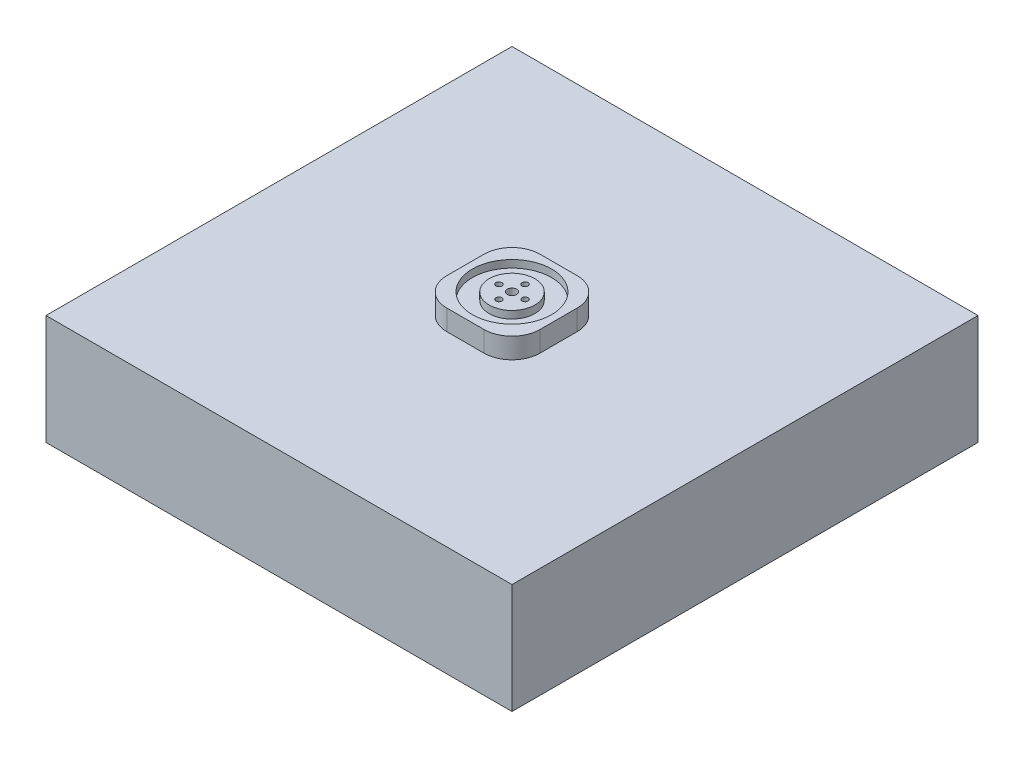
ISO-10303-21;
HEADER;
FILE_DESCRIPTION(('STEP AP214'),'2;1');
FILE_NAME('part.step','',(''),(''),'','','');
FILE_SCHEMA(('AUTOMOTIVE_DESIGN { 1 0 10303 214 1 1 1 1 }'));
ENDSEC;
DATA;
#1=APPLICATION_CONTEXT('core data for automotive mechanical design processes');
#2=APPLICATION_PROTOCOL_DEFINITION('international standard','automotive_design',2000,#1);
#3=PRODUCT_CONTEXT('',#1,'mechanical');
#4=PRODUCT('Part','Part','',(#3));
#5=PRODUCT_RELATED_PRODUCT_CATEGORY('part','',(#4));
#6=PRODUCT_DEFINITION_FORMATION('','',#4);
#7=PRODUCT_DEFINITION_CONTEXT('part definition',#1,'design');
#8=PRODUCT_DEFINITION('design','',#6,#7);
#9=PRODUCT_DEFINITION_SHAPE('','',#8);
#10=(LENGTH_UNIT() NAMED_UNIT(*) SI_UNIT(.MILLI.,.METRE.));
#11=(NAMED_UNIT(*) PLANE_ANGLE_UNIT() SI_UNIT($,.RADIAN.));
#12=(NAMED_UNIT(*) SI_UNIT($,.STERADIAN.) SOLID_ANGLE_UNIT());
#13=UNCERTAINTY_MEASURE_WITH_UNIT(LENGTH_MEASURE(1.E-05),#10,'distance_accuracy_value','');
#14=(GEOMETRIC_REPRESENTATION_CONTEXT(3) GLOBAL_UNCERTAINTY_ASSIGNED_CONTEXT((#13)) GLOBAL_UNIT_ASSIGNED_CONTEXT((#10,
#11,#12)) REPRESENTATION_CONTEXT('',''));
#15=CARTESIAN_POINT('',(0.,0.,0.));
#16=DIRECTION('',(0.,0.,1.));
#17=DIRECTION('',(1.,0.,0.));
#18=AXIS2_PLACEMENT_3D('',#15,#16,#17);
#19=CARTESIAN_POINT('',(-22.5,0.,44.));
#20=DIRECTION('',(0.,1.,0.));
#21=DIRECTION('',(0.,0.,1.));
#22=AXIS2_PLACEMENT_3D('',#19,#20,#21);
#23=PLANE('',#22);
#24=DIRECTION('',(-1.,0.,0.));
#25=VECTOR('',#24,1.);
#26=CARTESIAN_POINT('',(-60.855,0.,82.8559125763435));
#27=LINE('',#26,#25);
#28=CARTESIAN_POINT('',(60.855,0.,82.8559125763435));
#29=VERTEX_POINT('',#28);
#30=CARTESIAN_POINT('',(-60.855,0.,82.8559125763435));
#31=VERTEX_POINT('',#30);
#32=EDGE_CURVE('E172',#29,#31,#27,.T.);
#33=ORIENTED_EDGE('',*,*,#32,.T.);
#34=DIRECTION('',(0.,0.,-1.));
#35=VECTOR('',#34,1.);
#36=CARTESIAN_POINT('',(-60.855,0.,82.8559125763435));
#37=LINE('',#36,#35);
#38=CARTESIAN_POINT('',(-60.855,0.,-38.8559125763435));
#39=VERTEX_POINT('',#38);
#40=EDGE_CURVE('E191',#31,#39,#37,.T.);
#41=ORIENTED_EDGE('',*,*,#40,.T.);
#42=DIRECTION('',(1.,0.,0.));
#43=VECTOR('',#42,1.);
#44=CARTESIAN_POINT('',(-60.855,0.,-38.8559125763435));
#45=LINE('',#44,#43);
#46=CARTESIAN_POINT('',(60.855,0.,-38.8559125763435));
#47=VERTEX_POINT('',#46);
#48=EDGE_CURVE('E178',#39,#47,#45,.T.);
#49=ORIENTED_EDGE('',*,*,#48,.T.);
#50=DIRECTION('',(0.,0.,1.));
#51=VECTOR('',#50,1.);
#52=CARTESIAN_POINT('',(60.855,0.,82.8559125763435));
#53=LINE('',#52,#51);
#54=EDGE_CURVE('E194',#47,#29,#53,.T.);
#55=ORIENTED_EDGE('',*,*,#54,.T.);
#56=EDGE_LOOP('',(#33,#41,#49,#55));
#57=FACE_BOUND('',#56,.T.);
#58=CARTESIAN_POINT('',(-7.,0.,21.9999999999999));
#59=DIRECTION('',(0.,-1.,0.));
#60=DIRECTION('',(0.,0.,-1.));
#61=AXIS2_PLACEMENT_3D('',#58,#59,#60);
#62=CIRCLE('',#61,3.);
#63=CARTESIAN_POINT('',(-7.,0.,18.9999999999999));
#64=VERTEX_POINT('',#63);
#65=EDGE_CURVE('E217',#64,#64,#62,.T.);
#66=ORIENTED_EDGE('',*,*,#65,.F.);
#67=EDGE_LOOP('',(#66));
#68=FACE_BOUND('',#67,.T.);
#69=CARTESIAN_POINT('',(0.,0.,15.));
#70=DIRECTION('',(0.,-1.,0.));
#71=DIRECTION('',(0.,0.,-1.));
#72=AXIS2_PLACEMENT_3D('',#69,#70,#71);
#73=CIRCLE('',#72,3.);
#74=CARTESIAN_POINT('',(0.,0.,12.));
#75=VERTEX_POINT('',#74);
#76=EDGE_CURVE('E245',#75,#75,#73,.T.);
#77=ORIENTED_EDGE('',*,*,#76,.F.);
#78=EDGE_LOOP('',(#77));
#79=FACE_BOUND('',#78,.T.);
#80=CARTESIAN_POINT('',(7.,0.,22.));
#81=DIRECTION('',(0.,-1.,0.));
#82=DIRECTION('',(0.,0.,-1.));
#83=AXIS2_PLACEMENT_3D('',#80,#81,#82);
#84=CIRCLE('',#83,3.);
#85=CARTESIAN_POINT('',(7.,0.,19.));
#86=VERTEX_POINT('',#85);
#87=EDGE_CURVE('E239',#86,#86,#84,.T.);
#88=ORIENTED_EDGE('',*,*,#87,.F.);
#89=EDGE_LOOP('',(#88));
#90=FACE_BOUND('',#89,.T.);
#91=CARTESIAN_POINT('',(0.,0.,29.));
#92=DIRECTION('',(0.,-1.,0.));
#93=DIRECTION('',(0.,0.,-1.));
#94=AXIS2_PLACEMENT_3D('',#91,#92,#93);
#95=CIRCLE('',#94,3.);
#96=CARTESIAN_POINT('',(0.,0.,26.));
#97=VERTEX_POINT('',#96);
#98=EDGE_CURVE('E231',#97,#97,#95,.T.);
#99=ORIENTED_EDGE('',*,*,#98,.F.);
#100=EDGE_LOOP('',(#99));
#101=FACE_BOUND('',#100,.T.);
#102=ADVANCED_FACE('F47',(#57,#68,#79,#90,#101),#23,.F.);
#103=CARTESIAN_POINT('',(25.,20.,47.));
#104=DIRECTION('',(-1.,0.,0.));
#105=DIRECTION('',(0.,-1.,0.));
#106=AXIS2_PLACEMENT_3D('',#103,#104,#105);
#107=PLANE('',#106);
#108=DIRECTION('',(0.,0.,-1.));
#109=VECTOR('',#108,1.);
#110=CARTESIAN_POINT('',(25.,9.00000000000001,47.));
#111=LINE('',#110,#109);
#112=CARTESIAN_POINT('',(25.,9.00000000000001,32.));
#113=VERTEX_POINT('',#112);
#114=CARTESIAN_POINT('',(25.,9.00000000000001,12.));
#115=VERTEX_POINT('',#114);
#116=EDGE_CURVE('E283',#113,#115,#111,.T.);
#117=ORIENTED_EDGE('',*,*,#116,.T.);
#118=DIRECTION('',(0.,-1.,0.));
#119=VECTOR('',#118,1.);
#120=CARTESIAN_POINT('',(25.,20.,12.));
#121=LINE('',#120,#119);
#122=CARTESIAN_POINT('',(25.,20.,12.));
#123=VERTEX_POINT('',#122);
#124=EDGE_CURVE('E12',#115,#123,#121,.F.);
#125=ORIENTED_EDGE('',*,*,#124,.T.);
#126=DIRECTION('',(0.,0.,-1.));
#127=VECTOR('',#126,1.);
#128=CARTESIAN_POINT('',(25.,20.,47.));
#129=LINE('',#128,#127);
#130=CARTESIAN_POINT('',(25.,20.,32.));
#131=VERTEX_POINT('',#130);
#132=EDGE_CURVE('E286',#131,#123,#129,.T.);
#133=ORIENTED_EDGE('',*,*,#132,.F.);
#134=DIRECTION('',(0.,-1.,0.));
#135=VECTOR('',#134,1.);
#136=CARTESIAN_POINT('',(25.,20.,32.));
#137=LINE('',#136,#135);
#138=EDGE_CURVE('E56',#131,#113,#137,.T.);
#139=ORIENTED_EDGE('',*,*,#138,.T.);
#140=EDGE_LOOP('',(#117,#125,#133,#139));
#141=FACE_BOUND('',#140,.T.);
#142=ADVANCED_FACE('F372',(#141),#107,.F.);
#143=CARTESIAN_POINT('',(-25.,20.,-3.));
#144=DIRECTION('',(0.,0.,1.));
#145=DIRECTION('',(1.,0.,0.));
#146=AXIS2_PLACEMENT_3D('',#143,#144,#145);
#147=PLANE('',#146);
#148=DIRECTION('',(-1.,0.,0.));
#149=VECTOR('',#148,1.);
#150=CARTESIAN_POINT('',(-25.,9.,-3.));
#151=LINE('',#150,#149);
#152=CARTESIAN_POINT('',(10.,9.00000000000001,-3.));
#153=VERTEX_POINT('',#152);
#154=CARTESIAN_POINT('',(-10.,9.,-3.));
#155=VERTEX_POINT('',#154);
#156=EDGE_CURVE('E300',#153,#155,#151,.T.);
#157=ORIENTED_EDGE('',*,*,#156,.T.);
#158=DIRECTION('',(0.,-1.,0.));
#159=VECTOR('',#158,1.);
#160=CARTESIAN_POINT('',(-10.,20.,-3.));
#161=LINE('',#160,#159);
#162=CARTESIAN_POINT('',(-10.,20.,-3.));
#163=VERTEX_POINT('',#162);
#164=EDGE_CURVE('E72',#155,#163,#161,.F.);
#165=ORIENTED_EDGE('',*,*,#164,.T.);
#166=DIRECTION('',(-1.,0.,0.));
#167=VECTOR('',#166,1.);
#168=CARTESIAN_POINT('',(-25.,20.,-3.));
#169=LINE('',#168,#167);
#170=CARTESIAN_POINT('',(10.,20.,-3.));
#171=VERTEX_POINT('',#170);
#172=EDGE_CURVE('E289',#171,#163,#169,.T.);
#173=ORIENTED_EDGE('',*,*,#172,.F.);
#174=DIRECTION('',(0.,-1.,0.));
#175=VECTOR('',#174,1.);
#176=CARTESIAN_POINT('',(10.,20.,-3.));
#177=LINE('',#176,#175);
#178=EDGE_CURVE('E335',#171,#153,#177,.T.);
#179=ORIENTED_EDGE('',*,*,#178,.T.);
#180=EDGE_LOOP('',(#157,#165,#173,#179));
#181=FACE_BOUND('',#180,.T.);
#182=ADVANCED_FACE('F380',(#181),#147,.F.);
#183=CARTESIAN_POINT('',(-25.,20.,47.));
#184=DIRECTION('',(1.,0.,0.));
#185=DIRECTION('',(0.,1.,0.));
#186=AXIS2_PLACEMENT_3D('',#183,#184,#185);
#187=PLANE('',#186);
#188=DIRECTION('',(0.,0.,1.));
#189=VECTOR('',#188,1.);
#190=CARTESIAN_POINT('',(-25.,9.,47.));
#191=LINE('',#190,#189);
#192=CARTESIAN_POINT('',(-25.,9.,12.));
#193=VERTEX_POINT('',#192);
#194=CARTESIAN_POINT('',(-25.,9.,32.));
#195=VERTEX_POINT('',#194);
#196=EDGE_CURVE('E302',#193,#195,#191,.T.);
#197=ORIENTED_EDGE('',*,*,#196,.T.);
#198=DIRECTION('',(0.,-1.,0.));
#199=VECTOR('',#198,1.);
#200=CARTESIAN_POINT('',(-25.,20.,32.));
#201=LINE('',#200,#199);
#202=CARTESIAN_POINT('',(-25.,20.,32.));
#203=VERTEX_POINT('',#202);
#204=EDGE_CURVE('E325',#195,#203,#201,.F.);
#205=ORIENTED_EDGE('',*,*,#204,.T.);
#206=DIRECTION('',(0.,0.,1.));
#207=VECTOR('',#206,1.);
#208=CARTESIAN_POINT('',(-25.,20.,47.));
#209=LINE('',#208,#207);
#210=CARTESIAN_POINT('',(-25.,20.,12.));
#211=VERTEX_POINT('',#210);
#212=EDGE_CURVE('E292',#211,#203,#209,.T.);
#213=ORIENTED_EDGE('',*,*,#212,.F.);
#214=DIRECTION('',(0.,-1.,0.));
#215=VECTOR('',#214,1.);
#216=CARTESIAN_POINT('',(-25.,20.,12.));
#217=LINE('',#216,#215);
#218=EDGE_CURVE('E322',#211,#193,#217,.T.);
#219=ORIENTED_EDGE('',*,*,#218,.T.);
#220=EDGE_LOOP('',(#197,#205,#213,#219));
#221=FACE_BOUND('',#220,.T.);
#222=ADVANCED_FACE('F418',(#221),#187,.F.);
#223=CARTESIAN_POINT('',(-25.,20.,47.));
#224=DIRECTION('',(0.,0.,-1.));
#225=DIRECTION('',(-1.,0.,0.));
#226=AXIS2_PLACEMENT_3D('',#223,#224,#225);
#227=PLANE('',#226);
#228=DIRECTION('',(1.,0.,0.));
#229=VECTOR('',#228,1.);
#230=CARTESIAN_POINT('',(-25.,20.,47.));
#231=LINE('',#230,#229);
#232=CARTESIAN_POINT('',(-10.,20.,47.));
#233=VERTEX_POINT('',#232);
#234=CARTESIAN_POINT('',(10.,20.,47.));
#235=VERTEX_POINT('',#234);
#236=EDGE_CURVE('E295',#233,#235,#231,.T.);
#237=ORIENTED_EDGE('',*,*,#236,.F.);
#238=DIRECTION('',(0.,-1.,0.));
#239=VECTOR('',#238,1.);
#240=CARTESIAN_POINT('',(-10.,20.,47.));
#241=LINE('',#240,#239);
#242=CARTESIAN_POINT('',(-10.,9.,47.));
#243=VERTEX_POINT('',#242);
#244=EDGE_CURVE('E307',#233,#243,#241,.T.);
#245=ORIENTED_EDGE('',*,*,#244,.T.);
#246=DIRECTION('',(1.,0.,0.));
#247=VECTOR('',#246,1.);
#248=CARTESIAN_POINT('',(-25.,9.,47.));
#249=LINE('',#248,#247);
#250=CARTESIAN_POINT('',(10.,9.00000000000001,47.));
#251=VERTEX_POINT('',#250);
#252=EDGE_CURVE('E290',#243,#251,#249,.T.);
#253=ORIENTED_EDGE('',*,*,#252,.T.);
#254=DIRECTION('',(0.,-1.,0.));
#255=VECTOR('',#254,1.);
#256=CARTESIAN_POINT('',(10.,20.,47.));
#257=LINE('',#256,#255);
#258=EDGE_CURVE('E298',#251,#235,#257,.F.);
#259=ORIENTED_EDGE('',*,*,#258,.T.);
#260=EDGE_LOOP('',(#237,#245,#253,#259));
#261=FACE_BOUND('',#260,.T.);
#262=ADVANCED_FACE('F425',(#261),#227,.F.);
#263=CARTESIAN_POINT('',(0.,20.,0.));
#264=DIRECTION('',(0.,-1.,0.));
#265=DIRECTION('',(1.,0.,0.));
#266=AXIS2_PLACEMENT_3D('',#263,#264,#265);
#267=PLANE('',#266);
#268=CARTESIAN_POINT('',(0.,20.,22.));
#269=DIRECTION('',(0.,1.,0.));
#270=DIRECTION('',(-1.,0.,0.));
#271=AXIS2_PLACEMENT_3D('',#268,#269,#270);
#272=CIRCLE('',#271,21.25);
#273=CARTESIAN_POINT('',(-21.25,20.,22.));
#274=VERTEX_POINT('',#273);
#275=EDGE_CURVE('E277',#274,#274,#272,.T.);
#276=ORIENTED_EDGE('',*,*,#275,.F.);
#277=EDGE_LOOP('',(#276));
#278=FACE_BOUND('',#277,.T.);
#279=ORIENTED_EDGE('',*,*,#212,.T.);
#280=CARTESIAN_POINT('',(-10.,20.,32.));
#281=DIRECTION('',(0.,-1.,0.));
#282=DIRECTION('',(1.,0.,0.));
#283=AXIS2_PLACEMENT_3D('',#280,#281,#282);
#284=CIRCLE('',#283,15.);
#285=EDGE_CURVE('E333',#203,#233,#284,.F.);
#286=ORIENTED_EDGE('',*,*,#285,.T.);
#287=ORIENTED_EDGE('',*,*,#236,.T.);
#288=CARTESIAN_POINT('',(10.,20.,32.));
#289=DIRECTION('',(0.,-1.,0.));
#290=DIRECTION('',(1.,0.,0.));
#291=AXIS2_PLACEMENT_3D('',#288,#289,#290);
#292=CIRCLE('',#291,15.);
#293=EDGE_CURVE('E327',#235,#131,#292,.F.);
#294=ORIENTED_EDGE('',*,*,#293,.T.);
#295=ORIENTED_EDGE('',*,*,#132,.T.);
#296=CARTESIAN_POINT('',(10.,20.,12.));
#297=DIRECTION('',(0.,-1.,0.));
#298=DIRECTION('',(1.,0.,0.));
#299=AXIS2_PLACEMENT_3D('',#296,#297,#298);
#300=CIRCLE('',#299,15.);
#301=EDGE_CURVE('E329',#123,#171,#300,.F.);
#302=ORIENTED_EDGE('',*,*,#301,.T.);
#303=ORIENTED_EDGE('',*,*,#172,.T.);
#304=CARTESIAN_POINT('',(-10.,20.,12.));
#305=DIRECTION('',(0.,-1.,0.));
#306=DIRECTION('',(1.,0.,0.));
#307=AXIS2_PLACEMENT_3D('',#304,#305,#306);
#308=CIRCLE('',#307,15.);
#309=EDGE_CURVE('E331',#163,#211,#308,.F.);
#310=ORIENTED_EDGE('',*,*,#309,.T.);
#311=EDGE_LOOP('',(#279,#286,#287,#294,#295,#302,#303,#310));
#312=FACE_BOUND('',#311,.T.);
#313=ADVANCED_FACE('F406',(#278,#312),#267,.F.);
#314=CARTESIAN_POINT('',(0.,16.,22.));
#315=DIRECTION('',(0.,1.,0.));
#316=DIRECTION('',(-1.,0.,0.));
#317=AXIS2_PLACEMENT_3D('',#314,#315,#316);
#318=CYLINDRICAL_SURFACE('',#317,21.25);
#319=CARTESIAN_POINT('',(0.,16.,22.));
#320=DIRECTION('',(0.,1.,0.));
#321=DIRECTION('',(-1.,0.,0.));
#322=AXIS2_PLACEMENT_3D('',#319,#320,#321);
#323=CIRCLE('',#322,21.25);
#324=CARTESIAN_POINT('',(-21.25,16.,22.));
#325=VERTEX_POINT('',#324);
#326=EDGE_CURVE('E280',#325,#325,#323,.T.);
#327=ORIENTED_EDGE('',*,*,#326,.F.);
#328=EDGE_LOOP('',(#327));
#329=FACE_BOUND('',#328,.T.);
#330=ORIENTED_EDGE('',*,*,#275,.T.);
#331=EDGE_LOOP('',(#330));
#332=FACE_BOUND('',#331,.T.);
#333=ADVANCED_FACE('F434',(#329,#332),#318,.F.);
#334=CARTESIAN_POINT('',(0.,16.,22.));
#335=DIRECTION('',(0.,1.,0.));
#336=DIRECTION('',(-1.,0.,0.));
#337=AXIS2_PLACEMENT_3D('',#334,#335,#336);
#338=PLANE('',#337);
#339=CARTESIAN_POINT('',(0.,16.,22.));
#340=DIRECTION('',(0.,1.,0.));
#341=DIRECTION('',(-1.,0.,0.));
#342=AXIS2_PLACEMENT_3D('',#339,#340,#341);
#343=CIRCLE('',#342,12.25);
#344=CARTESIAN_POINT('',(-12.25,16.,22.));
#345=VERTEX_POINT('',#344);
#346=EDGE_CURVE('E274',#345,#345,#343,.T.);
#347=ORIENTED_EDGE('',*,*,#346,.F.);
#348=EDGE_LOOP('',(#347));
#349=FACE_BOUND('',#348,.T.);
#350=ORIENTED_EDGE('',*,*,#326,.T.);
#351=EDGE_LOOP('',(#350));
#352=FACE_BOUND('',#351,.T.);
#353=ADVANCED_FACE('F480',(#349,#352),#338,.T.);
#354=CARTESIAN_POINT('',(0.,16.,22.));
#355=DIRECTION('',(0.,1.,0.));
#356=DIRECTION('',(-1.,0.,0.));
#357=AXIS2_PLACEMENT_3D('',#354,#355,#356);
#358=CYLINDRICAL_SURFACE('',#357,12.25);
#359=ORIENTED_EDGE('',*,*,#346,.T.);
#360=EDGE_LOOP('',(#359));
#361=FACE_BOUND('',#360,.T.);
#362=CARTESIAN_POINT('',(0.,20.,22.));
#363=DIRECTION('',(0.,1.,0.));
#364=DIRECTION('',(-1.,0.,0.));
#365=AXIS2_PLACEMENT_3D('',#362,#363,#364);
#366=CIRCLE('',#365,12.25);
#367=CARTESIAN_POINT('',(-12.25,20.,22.));
#368=VERTEX_POINT('',#367);
#369=EDGE_CURVE('E265',#368,#368,#366,.T.);
#370=ORIENTED_EDGE('',*,*,#369,.F.);
#371=EDGE_LOOP('',(#370));
#372=FACE_BOUND('',#371,.T.);
#373=ADVANCED_FACE('F472',(#361,#372),#358,.T.);
#374=CARTESIAN_POINT('',(0.,20.,22.));
#375=DIRECTION('',(0.,1.,0.));
#376=DIRECTION('',(-1.,0.,0.));
#377=AXIS2_PLACEMENT_3D('',#374,#375,#376);
#378=CIRCLE('',#377,2.5);
#379=CARTESIAN_POINT('',(-2.5,20.,22.));
#380=VERTEX_POINT('',#379);
#381=EDGE_CURVE('E259',#380,#380,#378,.T.);
#382=ORIENTED_EDGE('',*,*,#381,.F.);
#383=EDGE_LOOP('',(#382));
#384=FACE_BOUND('',#383,.T.);
#385=CARTESIAN_POINT('',(0.,20.,15.));
#386=DIRECTION('',(0.,1.,0.));
#387=DIRECTION('',(-1.,0.,0.));
#388=AXIS2_PLACEMENT_3D('',#385,#386,#387);
#389=CIRCLE('',#388,1.6);
#390=CARTESIAN_POINT('',(-1.6,20.,15.));
#391=VERTEX_POINT('',#390);
#392=EDGE_CURVE('E262',#391,#391,#389,.T.);
#393=ORIENTED_EDGE('',*,*,#392,.F.);
#394=EDGE_LOOP('',(#393));
#395=FACE_BOUND('',#394,.T.);
#396=CARTESIAN_POINT('',(-7.,20.,21.9999999999999));
#397=DIRECTION('',(0.,1.,0.));
#398=DIRECTION('',(-1.,0.,0.));
#399=AXIS2_PLACEMENT_3D('',#396,#397,#398);
#400=CIRCLE('',#399,1.6);
#401=CARTESIAN_POINT('',(-8.6,20.,21.9999999999999));
#402=VERTEX_POINT('',#401);
#403=EDGE_CURVE('E266',#402,#402,#400,.T.);
#404=ORIENTED_EDGE('',*,*,#403,.F.);
#405=EDGE_LOOP('',(#404));
#406=FACE_BOUND('',#405,.T.);
#407=CARTESIAN_POINT('',(6.99999999999999,20.,22.));
#408=DIRECTION('',(0.,1.,0.));
#409=DIRECTION('',(-1.,0.,0.));
#410=AXIS2_PLACEMENT_3D('',#407,#408,#409);
#411=CIRCLE('',#410,1.6);
#412=CARTESIAN_POINT('',(5.4,20.,22.));
#413=VERTEX_POINT('',#412);
#414=EDGE_CURVE('E269',#413,#413,#411,.T.);
#415=ORIENTED_EDGE('',*,*,#414,.F.);
#416=EDGE_LOOP('',(#415));
#417=FACE_BOUND('',#416,.T.);
#418=CARTESIAN_POINT('',(0.,20.,29.));
#419=DIRECTION('',(0.,1.,0.));
#420=DIRECTION('',(-1.,0.,0.));
#421=AXIS2_PLACEMENT_3D('',#418,#419,#420);
#422=CIRCLE('',#421,1.6);
#423=CARTESIAN_POINT('',(-1.60000000000005,20.,29.));
#424=VERTEX_POINT('',#423);
#425=EDGE_CURVE('E258',#424,#424,#422,.T.);
#426=ORIENTED_EDGE('',*,*,#425,.F.);
#427=EDGE_LOOP('',(#426));
#428=FACE_BOUND('',#427,.T.);
#429=ORIENTED_EDGE('',*,*,#369,.T.);
#430=EDGE_LOOP('',(#429));
#431=FACE_BOUND('',#430,.T.);
#432=ADVANCED_FACE('F437',(#384,#395,#406,#417,#428,#431),#267,.F.);
#433=CARTESIAN_POINT('',(0.,-4.5254833995939,29.));
#434=DIRECTION('',(0.,1.,0.));
#435=DIRECTION('',(0.,0.,1.));
#436=AXIS2_PLACEMENT_3D('',#433,#434,#435);
#437=CYLINDRICAL_SURFACE('',#436,1.6);
#438=CARTESIAN_POINT('',(0.,15.,29.));
#439=DIRECTION('',(0.,1.,0.));
#440=DIRECTION('',(-1.,0.,0.));
#441=AXIS2_PLACEMENT_3D('',#438,#439,#440);
#442=CIRCLE('',#441,1.6);
#443=CARTESIAN_POINT('',(-1.60000000000005,15.,29.));
#444=VERTEX_POINT('',#443);
#445=EDGE_CURVE('E51',#444,#444,#442,.F.);
#446=ORIENTED_EDGE('',*,*,#445,.T.);
#447=EDGE_LOOP('',(#446));
#448=FACE_BOUND('',#447,.T.);
#449=ORIENTED_EDGE('',*,*,#425,.T.);
#450=EDGE_LOOP('',(#449));
#451=FACE_BOUND('',#450,.T.);
#452=ADVANCED_FACE('F352',(#448,#451),#437,.F.);
#453=CARTESIAN_POINT('',(6.99999999999999,-4.5254833995939,22.));
#454=DIRECTION('',(0.,1.,0.));
#455=DIRECTION('',(0.,0.,1.));
#456=AXIS2_PLACEMENT_3D('',#453,#454,#455);
#457=CYLINDRICAL_SURFACE('',#456,1.6);
#458=CARTESIAN_POINT('',(6.99999999999999,15.,22.));
#459=DIRECTION('',(0.,1.,0.));
#460=DIRECTION('',(-1.,0.,0.));
#461=AXIS2_PLACEMENT_3D('',#458,#459,#460);
#462=CIRCLE('',#461,1.6);
#463=CARTESIAN_POINT('',(5.4,15.,22.));
#464=VERTEX_POINT('',#463);
#465=EDGE_CURVE('E345',#464,#464,#462,.F.);
#466=ORIENTED_EDGE('',*,*,#465,.T.);
#467=EDGE_LOOP('',(#466));
#468=FACE_BOUND('',#467,.T.);
#469=ORIENTED_EDGE('',*,*,#414,.T.);
#470=EDGE_LOOP('',(#469));
#471=FACE_BOUND('',#470,.T.);
#472=ADVANCED_FACE('F506',(#468,#471),#457,.F.);
#473=CARTESIAN_POINT('',(-7.,-4.52548339959391,21.9999999999999));
#474=DIRECTION('',(0.,1.,0.));
#475=DIRECTION('',(0.,0.,1.));
#476=AXIS2_PLACEMENT_3D('',#473,#474,#475);
#477=CYLINDRICAL_SURFACE('',#476,1.6);
#478=CARTESIAN_POINT('',(-7.,15.,21.9999999999999));
#479=DIRECTION('',(0.,1.,0.));
#480=DIRECTION('',(-1.,0.,0.));
#481=AXIS2_PLACEMENT_3D('',#478,#479,#480);
#482=CIRCLE('',#481,1.6);
#483=CARTESIAN_POINT('',(-8.6,15.,21.9999999999999));
#484=VERTEX_POINT('',#483);
#485=EDGE_CURVE('E343',#484,#484,#482,.F.);
#486=ORIENTED_EDGE('',*,*,#485,.T.);
#487=EDGE_LOOP('',(#486));
#488=FACE_BOUND('',#487,.T.);
#489=ORIENTED_EDGE('',*,*,#403,.T.);
#490=EDGE_LOOP('',(#489));
#491=FACE_BOUND('',#490,.T.);
#492=ADVANCED_FACE('F515',(#488,#491),#477,.F.);
#493=CARTESIAN_POINT('',(0.,-4.5254833995939,15.));
#494=DIRECTION('',(0.,1.,0.));
#495=DIRECTION('',(0.,0.,1.));
#496=AXIS2_PLACEMENT_3D('',#493,#494,#495);
#497=CYLINDRICAL_SURFACE('',#496,1.6);
#498=CARTESIAN_POINT('',(0.,15.,15.));
#499=DIRECTION('',(0.,1.,0.));
#500=DIRECTION('',(-1.,0.,0.));
#501=AXIS2_PLACEMENT_3D('',#498,#499,#500);
#502=CIRCLE('',#501,1.6);
#503=CARTESIAN_POINT('',(-1.6,15.,15.));
#504=VERTEX_POINT('',#503);
#505=EDGE_CURVE('E238',#504,#504,#502,.F.);
#506=ORIENTED_EDGE('',*,*,#505,.T.);
#507=EDGE_LOOP('',(#506));
#508=FACE_BOUND('',#507,.T.);
#509=ORIENTED_EDGE('',*,*,#392,.T.);
#510=EDGE_LOOP('',(#509));
#511=FACE_BOUND('',#510,.T.);
#512=ADVANCED_FACE('F524',(#508,#511),#497,.F.);
#513=CARTESIAN_POINT('',(0.,15.,22.));
#514=DIRECTION('',(0.,1.,0.));
#515=DIRECTION('',(-1.,0.,0.));
#516=AXIS2_PLACEMENT_3D('',#513,#514,#515);
#517=CYLINDRICAL_SURFACE('',#516,2.5);
#518=CARTESIAN_POINT('',(0.,15.,22.));
#519=DIRECTION('',(0.,1.,0.));
#520=DIRECTION('',(-1.,0.,0.));
#521=AXIS2_PLACEMENT_3D('',#518,#519,#520);
#522=CIRCLE('',#521,2.5);
#523=CARTESIAN_POINT('',(-2.5,15.,22.));
#524=VERTEX_POINT('',#523);
#525=EDGE_CURVE('E255',#524,#524,#522,.T.);
#526=ORIENTED_EDGE('',*,*,#525,.F.);
#527=EDGE_LOOP('',(#526));
#528=FACE_BOUND('',#527,.T.);
#529=ORIENTED_EDGE('',*,*,#381,.T.);
#530=EDGE_LOOP('',(#529));
#531=FACE_BOUND('',#530,.T.);
#532=ADVANCED_FACE('F534',(#528,#531),#517,.F.);
#533=CARTESIAN_POINT('',(0.,15.,0.));
#534=DIRECTION('',(0.,1.,0.));
#535=DIRECTION('',(-1.,0.,0.));
#536=AXIS2_PLACEMENT_3D('',#533,#534,#535);
#537=PLANE('',#536);
#538=ORIENTED_EDGE('',*,*,#525,.T.);
#539=EDGE_LOOP('',(#538));
#540=FACE_BOUND('',#539,.T.);
#541=ADVANCED_FACE('F390',(#540),#537,.T.);
#542=CARTESIAN_POINT('',(-10.,20.,32.));
#543=DIRECTION('',(0.,-1.,0.));
#544=DIRECTION('',(1.,0.,0.));
#545=AXIS2_PLACEMENT_3D('',#542,#543,#544);
#546=CYLINDRICAL_SURFACE('',#545,15.);
#547=ORIENTED_EDGE('',*,*,#285,.F.);
#548=ORIENTED_EDGE('',*,*,#204,.F.);
#549=CARTESIAN_POINT('',(-10.,9.,32.));
#550=DIRECTION('',(0.,-1.,0.));
#551=DIRECTION('',(1.,0.,0.));
#552=AXIS2_PLACEMENT_3D('',#549,#550,#551);
#553=CIRCLE('',#552,15.);
#554=EDGE_CURVE('E319',#243,#195,#553,.T.);
#555=ORIENTED_EDGE('',*,*,#554,.F.);
#556=ORIENTED_EDGE('',*,*,#244,.F.);
#557=EDGE_LOOP('',(#547,#548,#555,#556));
#558=FACE_BOUND('',#557,.T.);
#559=ADVANCED_FACE('F386',(#558),#546,.T.);
#560=CARTESIAN_POINT('',(-10.,20.,12.));
#561=DIRECTION('',(0.,-1.,0.));
#562=DIRECTION('',(1.,0.,0.));
#563=AXIS2_PLACEMENT_3D('',#560,#561,#562);
#564=CYLINDRICAL_SURFACE('',#563,15.);
#565=ORIENTED_EDGE('',*,*,#309,.F.);
#566=ORIENTED_EDGE('',*,*,#164,.F.);
#567=CARTESIAN_POINT('',(-10.,9.,12.));
#568=DIRECTION('',(0.,-1.,0.));
#569=DIRECTION('',(1.,0.,0.));
#570=AXIS2_PLACEMENT_3D('',#567,#568,#569);
#571=CIRCLE('',#570,15.);
#572=EDGE_CURVE('E316',#193,#155,#571,.T.);
#573=ORIENTED_EDGE('',*,*,#572,.F.);
#574=ORIENTED_EDGE('',*,*,#218,.F.);
#575=EDGE_LOOP('',(#565,#566,#573,#574));
#576=FACE_BOUND('',#575,.T.);
#577=ADVANCED_FACE('F389',(#576),#564,.T.);
#578=CARTESIAN_POINT('',(10.,20.,12.));
#579=DIRECTION('',(0.,-1.,0.));
#580=DIRECTION('',(1.,0.,0.));
#581=AXIS2_PLACEMENT_3D('',#578,#579,#580);
#582=CYLINDRICAL_SURFACE('',#581,15.);
#583=ORIENTED_EDGE('',*,*,#301,.F.);
#584=ORIENTED_EDGE('',*,*,#124,.F.);
#585=CARTESIAN_POINT('',(10.,9.00000000000001,12.));
#586=DIRECTION('',(0.,-1.,0.));
#587=DIRECTION('',(1.,0.,0.));
#588=AXIS2_PLACEMENT_3D('',#585,#586,#587);
#589=CIRCLE('',#588,15.);
#590=EDGE_CURVE('E313',#153,#115,#589,.T.);
#591=ORIENTED_EDGE('',*,*,#590,.F.);
#592=ORIENTED_EDGE('',*,*,#178,.F.);
#593=EDGE_LOOP('',(#583,#584,#591,#592));
#594=FACE_BOUND('',#593,.T.);
#595=ADVANCED_FACE('F393',(#594),#582,.T.);
#596=CARTESIAN_POINT('',(10.,20.,32.));
#597=DIRECTION('',(0.,-1.,0.));
#598=DIRECTION('',(1.,0.,0.));
#599=AXIS2_PLACEMENT_3D('',#596,#597,#598);
#600=CYLINDRICAL_SURFACE('',#599,15.);
#601=ORIENTED_EDGE('',*,*,#293,.F.);
#602=ORIENTED_EDGE('',*,*,#258,.F.);
#603=CARTESIAN_POINT('',(10.,9.00000000000001,32.));
#604=DIRECTION('',(0.,-1.,0.));
#605=DIRECTION('',(1.,0.,0.));
#606=AXIS2_PLACEMENT_3D('',#603,#604,#605);
#607=CIRCLE('',#606,15.);
#608=EDGE_CURVE('E310',#113,#251,#607,.T.);
#609=ORIENTED_EDGE('',*,*,#608,.F.);
#610=ORIENTED_EDGE('',*,*,#138,.F.);
#611=EDGE_LOOP('',(#601,#602,#609,#610));
#612=FACE_BOUND('',#611,.T.);
#613=ADVANCED_FACE('F49',(#612),#600,.T.);
#614=CARTESIAN_POINT('',(0.,15.,22.));
#615=DIRECTION('',(0.,1.,0.));
#616=DIRECTION('',(-1.,0.,0.));
#617=AXIS2_PLACEMENT_3D('',#614,#615,#616);
#618=PLANE('',#617);
#619=CARTESIAN_POINT('',(0.,15.,15.));
#620=DIRECTION('',(0.,1.,0.));
#621=DIRECTION('',(-1.,0.,0.));
#622=AXIS2_PLACEMENT_3D('',#619,#620,#621);
#623=CIRCLE('',#622,3.);
#624=CARTESIAN_POINT('',(-3.,15.,15.));
#625=VERTEX_POINT('',#624);
#626=EDGE_CURVE('E242',#625,#625,#623,.F.);
#627=ORIENTED_EDGE('',*,*,#626,.T.);
#628=EDGE_LOOP('',(#627));
#629=FACE_BOUND('',#628,.T.);
#630=ORIENTED_EDGE('',*,*,#505,.F.);
#631=EDGE_LOOP('',(#630));
#632=FACE_BOUND('',#631,.T.);
#633=ADVANCED_FACE('F400',(#629,#632),#618,.F.);
#634=CARTESIAN_POINT('',(0.,24.4852813742386,15.));
#635=DIRECTION('',(0.,-1.,0.));
#636=DIRECTION('',(0.,0.,-1.));
#637=AXIS2_PLACEMENT_3D('',#634,#635,#636);
#638=CYLINDRICAL_SURFACE('',#637,3.);
#639=ORIENTED_EDGE('',*,*,#76,.T.);
#640=EDGE_LOOP('',(#639));
#641=FACE_BOUND('',#640,.T.);
#642=ORIENTED_EDGE('',*,*,#626,.F.);
#643=EDGE_LOOP('',(#642));
#644=FACE_BOUND('',#643,.T.);
#645=ADVANCED_FACE('F583',(#641,#644),#638,.F.);
#646=CARTESIAN_POINT('',(0.,15.,22.));
#647=DIRECTION('',(0.,1.,0.));
#648=DIRECTION('',(-1.,0.,0.));
#649=AXIS2_PLACEMENT_3D('',#646,#647,#648);
#650=PLANE('',#649);
#651=CARTESIAN_POINT('',(-7.,15.,21.9999999999999));
#652=DIRECTION('',(0.,1.,0.));
#653=DIRECTION('',(-1.,0.,0.));
#654=AXIS2_PLACEMENT_3D('',#651,#652,#653);
#655=CIRCLE('',#654,3.);
#656=CARTESIAN_POINT('',(-10.,15.,21.9999999999999));
#657=VERTEX_POINT('',#656);
#658=EDGE_CURVE('E248',#657,#657,#655,.F.);
#659=ORIENTED_EDGE('',*,*,#658,.T.);
#660=EDGE_LOOP('',(#659));
#661=FACE_BOUND('',#660,.T.);
#662=ORIENTED_EDGE('',*,*,#485,.F.);
#663=EDGE_LOOP('',(#662));
#664=FACE_BOUND('',#663,.T.);
#665=ADVANCED_FACE('F593',(#661,#664),#650,.F.);
#666=CARTESIAN_POINT('',(-7.,24.4852813742386,21.9999999999999));
#667=DIRECTION('',(0.,-1.,0.));
#668=DIRECTION('',(0.,0.,-1.));
#669=AXIS2_PLACEMENT_3D('',#666,#667,#668);
#670=CYLINDRICAL_SURFACE('',#669,3.);
#671=ORIENTED_EDGE('',*,*,#65,.T.);
#672=EDGE_LOOP('',(#671));
#673=FACE_BOUND('',#672,.T.);
#674=ORIENTED_EDGE('',*,*,#658,.F.);
#675=EDGE_LOOP('',(#674));
#676=FACE_BOUND('',#675,.T.);
#677=ADVANCED_FACE('F603',(#673,#676),#670,.F.);
#678=CARTESIAN_POINT('',(0.,15.,22.));
#679=DIRECTION('',(0.,1.,0.));
#680=DIRECTION('',(-1.,0.,0.));
#681=AXIS2_PLACEMENT_3D('',#678,#679,#680);
#682=PLANE('',#681);
#683=CARTESIAN_POINT('',(7.,15.,22.));
#684=DIRECTION('',(0.,1.,0.));
#685=DIRECTION('',(-1.,0.,0.));
#686=AXIS2_PLACEMENT_3D('',#683,#684,#685);
#687=CIRCLE('',#686,3.);
#688=CARTESIAN_POINT('',(4.,15.,22.));
#689=VERTEX_POINT('',#688);
#690=EDGE_CURVE('E235',#689,#689,#687,.F.);
#691=ORIENTED_EDGE('',*,*,#690,.T.);
#692=EDGE_LOOP('',(#691));
#693=FACE_BOUND('',#692,.T.);
#694=ORIENTED_EDGE('',*,*,#465,.F.);
#695=EDGE_LOOP('',(#694));
#696=FACE_BOUND('',#695,.T.);
#697=ADVANCED_FACE('F368',(#693,#696),#682,.F.);
#698=CARTESIAN_POINT('',(7.,24.4852813742386,22.));
#699=DIRECTION('',(0.,-1.,0.));
#700=DIRECTION('',(0.,0.,-1.));
#701=AXIS2_PLACEMENT_3D('',#698,#699,#700);
#702=CYLINDRICAL_SURFACE('',#701,3.);
#703=ORIENTED_EDGE('',*,*,#87,.T.);
#704=EDGE_LOOP('',(#703));
#705=FACE_BOUND('',#704,.T.);
#706=ORIENTED_EDGE('',*,*,#690,.F.);
#707=EDGE_LOOP('',(#706));
#708=FACE_BOUND('',#707,.T.);
#709=ADVANCED_FACE('F358',(#705,#708),#702,.F.);
#710=CARTESIAN_POINT('',(0.,15.,22.));
#711=DIRECTION('',(0.,1.,0.));
#712=DIRECTION('',(-1.,0.,0.));
#713=AXIS2_PLACEMENT_3D('',#710,#711,#712);
#714=PLANE('',#713);
#715=CARTESIAN_POINT('',(0.,15.,29.));
#716=DIRECTION('',(0.,1.,0.));
#717=DIRECTION('',(-1.,0.,0.));
#718=AXIS2_PLACEMENT_3D('',#715,#716,#717);
#719=CIRCLE('',#718,3.);
#720=CARTESIAN_POINT('',(-3.00000000000005,15.,29.));
#721=VERTEX_POINT('',#720);
#722=EDGE_CURVE('E234',#721,#721,#719,.F.);
#723=ORIENTED_EDGE('',*,*,#722,.T.);
#724=EDGE_LOOP('',(#723));
#725=FACE_BOUND('',#724,.T.);
#726=ORIENTED_EDGE('',*,*,#445,.F.);
#727=EDGE_LOOP('',(#726));
#728=FACE_BOUND('',#727,.T.);
#729=ADVANCED_FACE('F355',(#725,#728),#714,.F.);
#730=CARTESIAN_POINT('',(0.,24.4852813742386,29.));
#731=DIRECTION('',(0.,-1.,0.));
#732=DIRECTION('',(0.,0.,-1.));
#733=AXIS2_PLACEMENT_3D('',#730,#731,#732);
#734=CYLINDRICAL_SURFACE('',#733,3.);
#735=ORIENTED_EDGE('',*,*,#98,.T.);
#736=EDGE_LOOP('',(#735));
#737=FACE_BOUND('',#736,.T.);
#738=ORIENTED_EDGE('',*,*,#722,.F.);
#739=EDGE_LOOP('',(#738));
#740=FACE_BOUND('',#739,.T.);
#741=ADVANCED_FACE('F357',(#737,#740),#734,.F.);
#742=CARTESIAN_POINT('',(-125.,362.553390593274,-103.));
#743=DIRECTION('',(0.,0.,-1.));
#744=DIRECTION('',(-1.,0.,0.));
#745=AXIS2_PLACEMENT_3D('',#742,#743,#744);
#746=PLANE('',#745);
#747=DIRECTION('',(-1.,0.,0.));
#748=VECTOR('',#747,1.);
#749=CARTESIAN_POINT('',(-125.,9.00000000000001,-103.));
#750=LINE('',#749,#748);
#751=CARTESIAN_POINT('',(125.,9.00000000000001,-103.));
#752=VERTEX_POINT('',#751);
#753=CARTESIAN_POINT('',(-125.,9.00000000000001,-103.));
#754=VERTEX_POINT('',#753);
#755=EDGE_CURVE('E215',#752,#754,#750,.T.);
#756=ORIENTED_EDGE('',*,*,#755,.F.);
#757=DIRECTION('',(0.,-1.,0.));
#758=VECTOR('',#757,1.);
#759=CARTESIAN_POINT('',(125.,362.553390593274,-103.));
#760=LINE('',#759,#758);
#761=CARTESIAN_POINT('',(125.,-50.,-103.));
#762=VERTEX_POINT('',#761);
#763=EDGE_CURVE('E228',#752,#762,#760,.T.);
#764=ORIENTED_EDGE('',*,*,#763,.T.);
#765=DIRECTION('',(1.,0.,0.));
#766=VECTOR('',#765,1.);
#767=CARTESIAN_POINT('',(-125.,-50.,-103.));
#768=LINE('',#767,#766);
#769=CARTESIAN_POINT('',(-125.,-50.,-103.));
#770=VERTEX_POINT('',#769);
#771=EDGE_CURVE('E205',#770,#762,#768,.T.);
#772=ORIENTED_EDGE('',*,*,#771,.F.);
#773=DIRECTION('',(0.,-1.,0.));
#774=VECTOR('',#773,1.);
#775=CARTESIAN_POINT('',(-125.,362.553390593274,-103.));
#776=LINE('',#775,#774);
#777=EDGE_CURVE('E214',#754,#770,#776,.T.);
#778=ORIENTED_EDGE('',*,*,#777,.F.);
#779=EDGE_LOOP('',(#756,#764,#772,#778));
#780=FACE_BOUND('',#779,.T.);
#781=ADVANCED_FACE('F365',(#780),#746,.T.);
#782=CARTESIAN_POINT('',(125.,362.553390593274,147.));
#783=DIRECTION('',(1.,0.,0.));
#784=DIRECTION('',(0.,0.,-1.));
#785=AXIS2_PLACEMENT_3D('',#782,#783,#784);
#786=PLANE('',#785);
#787=DIRECTION('',(0.,0.,-1.));
#788=VECTOR('',#787,1.);
#789=CARTESIAN_POINT('',(125.,9.00000000000001,147.));
#790=LINE('',#789,#788);
#791=CARTESIAN_POINT('',(125.,9.00000000000001,147.));
#792=VERTEX_POINT('',#791);
#793=EDGE_CURVE('E219',#792,#752,#790,.T.);
#794=ORIENTED_EDGE('',*,*,#793,.F.);
#795=DIRECTION('',(0.,-1.,0.));
#796=VECTOR('',#795,1.);
#797=CARTESIAN_POINT('',(125.,362.553390593274,147.));
#798=LINE('',#797,#796);
#799=CARTESIAN_POINT('',(125.,-50.,147.));
#800=VERTEX_POINT('',#799);
#801=EDGE_CURVE('E226',#792,#800,#798,.T.);
#802=ORIENTED_EDGE('',*,*,#801,.T.);
#803=DIRECTION('',(0.,0.,1.));
#804=VECTOR('',#803,1.);
#805=CARTESIAN_POINT('',(125.,-50.,147.));
#806=LINE('',#805,#804);
#807=EDGE_CURVE('E208',#762,#800,#806,.T.);
#808=ORIENTED_EDGE('',*,*,#807,.F.);
#809=ORIENTED_EDGE('',*,*,#763,.F.);
#810=EDGE_LOOP('',(#794,#802,#808,#809));
#811=FACE_BOUND('',#810,.T.);
#812=ADVANCED_FACE('F653',(#811),#786,.T.);
#813=CARTESIAN_POINT('',(-125.,362.553390593274,147.));
#814=DIRECTION('',(0.,0.,1.));
#815=DIRECTION('',(1.,0.,0.));
#816=AXIS2_PLACEMENT_3D('',#813,#814,#815);
#817=PLANE('',#816);
#818=DIRECTION('',(1.,0.,0.));
#819=VECTOR('',#818,1.);
#820=CARTESIAN_POINT('',(-125.,9.00000000000001,147.));
#821=LINE('',#820,#819);
#822=CARTESIAN_POINT('',(-125.,9.00000000000001,147.));
#823=VERTEX_POINT('',#822);
#824=EDGE_CURVE('E221',#823,#792,#821,.T.);
#825=ORIENTED_EDGE('',*,*,#824,.F.);
#826=DIRECTION('',(0.,-1.,0.));
#827=VECTOR('',#826,1.);
#828=CARTESIAN_POINT('',(-125.,362.553390593274,147.));
#829=LINE('',#828,#827);
#830=CARTESIAN_POINT('',(-125.,-50.,147.));
#831=VERTEX_POINT('',#830);
#832=EDGE_CURVE('E222',#823,#831,#829,.T.);
#833=ORIENTED_EDGE('',*,*,#832,.T.);
#834=DIRECTION('',(-1.,0.,0.));
#835=VECTOR('',#834,1.);
#836=CARTESIAN_POINT('',(-125.,-50.,147.));
#837=LINE('',#836,#835);
#838=EDGE_CURVE('E211',#800,#831,#837,.T.);
#839=ORIENTED_EDGE('',*,*,#838,.F.);
#840=ORIENTED_EDGE('',*,*,#801,.F.);
#841=EDGE_LOOP('',(#825,#833,#839,#840));
#842=FACE_BOUND('',#841,.T.);
#843=ADVANCED_FACE('F666',(#842),#817,.T.);
#844=CARTESIAN_POINT('',(-125.,362.553390593274,147.));
#845=DIRECTION('',(-1.,0.,0.));
#846=DIRECTION('',(0.,0.,1.));
#847=AXIS2_PLACEMENT_3D('',#844,#845,#846);
#848=PLANE('',#847);
#849=DIRECTION('',(0.,0.,1.));
#850=VECTOR('',#849,1.);
#851=CARTESIAN_POINT('',(-125.,9.00000000000001,147.));
#852=LINE('',#851,#850);
#853=EDGE_CURVE('E218',#754,#823,#852,.T.);
#854=ORIENTED_EDGE('',*,*,#853,.F.);
#855=ORIENTED_EDGE('',*,*,#777,.T.);
#856=DIRECTION('',(0.,0.,-1.));
#857=VECTOR('',#856,1.);
#858=CARTESIAN_POINT('',(-125.,-50.,147.));
#859=LINE('',#858,#857);
#860=EDGE_CURVE('E179',#831,#770,#859,.T.);
#861=ORIENTED_EDGE('',*,*,#860,.F.);
#862=ORIENTED_EDGE('',*,*,#832,.F.);
#863=EDGE_LOOP('',(#854,#855,#861,#862));
#864=FACE_BOUND('',#863,.T.);
#865=ADVANCED_FACE('F678',(#864),#848,.T.);
#866=CARTESIAN_POINT('',(0.,9.,0.));
#867=DIRECTION('',(0.,-1.,0.));
#868=DIRECTION('',(1.,0.,0.));
#869=AXIS2_PLACEMENT_3D('',#866,#867,#868);
#870=PLANE('',#869);
#871=ORIENTED_EDGE('',*,*,#572,.T.);
#872=ORIENTED_EDGE('',*,*,#156,.F.);
#873=ORIENTED_EDGE('',*,*,#590,.T.);
#874=ORIENTED_EDGE('',*,*,#116,.F.);
#875=ORIENTED_EDGE('',*,*,#608,.T.);
#876=ORIENTED_EDGE('',*,*,#252,.F.);
#877=ORIENTED_EDGE('',*,*,#554,.T.);
#878=ORIENTED_EDGE('',*,*,#196,.F.);
#879=EDGE_LOOP('',(#871,#872,#873,#874,#875,#876,#877,#878));
#880=FACE_BOUND('',#879,.T.);
#881=ORIENTED_EDGE('',*,*,#853,.T.);
#882=ORIENTED_EDGE('',*,*,#824,.T.);
#883=ORIENTED_EDGE('',*,*,#793,.T.);
#884=ORIENTED_EDGE('',*,*,#755,.T.);
#885=EDGE_LOOP('',(#881,#882,#883,#884));
#886=FACE_BOUND('',#885,.T.);
#887=ADVANCED_FACE('F411',(#880,#886),#870,.F.);
#888=CARTESIAN_POINT('',(0.,-50.,0.));
#889=DIRECTION('',(0.,-1.,0.));
#890=DIRECTION('',(0.,0.,-1.));
#891=AXIS2_PLACEMENT_3D('',#888,#889,#890);
#892=PLANE('',#891);
#893=ORIENTED_EDGE('',*,*,#860,.T.);
#894=ORIENTED_EDGE('',*,*,#771,.T.);
#895=ORIENTED_EDGE('',*,*,#807,.T.);
#896=ORIENTED_EDGE('',*,*,#838,.T.);
#897=EDGE_LOOP('',(#893,#894,#895,#896));
#898=FACE_BOUND('',#897,.T.);
#899=DIRECTION('',(1.,0.,0.));
#900=VECTOR('',#899,1.);
#901=CARTESIAN_POINT('',(-60.855,-50.,-38.8559125763435));
#902=LINE('',#901,#900);
#903=CARTESIAN_POINT('',(-60.855,-50.,-38.8559125763435));
#904=VERTEX_POINT('',#903);
#905=CARTESIAN_POINT('',(60.855,-50.,-38.8559125763435));
#906=VERTEX_POINT('',#905);
#907=EDGE_CURVE('E171',#904,#906,#902,.T.);
#908=ORIENTED_EDGE('',*,*,#907,.F.);
#909=DIRECTION('',(0.,0.,-1.));
#910=VECTOR('',#909,1.);
#911=CARTESIAN_POINT('',(-60.855,-50.,82.8559125763435));
#912=LINE('',#911,#910);
#913=CARTESIAN_POINT('',(-60.855,-50.,82.8559125763435));
#914=VERTEX_POINT('',#913);
#915=EDGE_CURVE('E163',#914,#904,#912,.T.);
#916=ORIENTED_EDGE('',*,*,#915,.F.);
#917=DIRECTION('',(-1.,0.,0.));
#918=VECTOR('',#917,1.);
#919=CARTESIAN_POINT('',(-60.855,-50.,82.8559125763435));
#920=LINE('',#919,#918);
#921=CARTESIAN_POINT('',(60.855,-50.,82.8559125763435));
#922=VERTEX_POINT('',#921);
#923=EDGE_CURVE('E187',#922,#914,#920,.T.);
#924=ORIENTED_EDGE('',*,*,#923,.F.);
#925=DIRECTION('',(0.,0.,1.));
#926=VECTOR('',#925,1.);
#927=CARTESIAN_POINT('',(60.855,-50.,82.8559125763435));
#928=LINE('',#927,#926);
#929=EDGE_CURVE('E185',#906,#922,#928,.T.);
#930=ORIENTED_EDGE('',*,*,#929,.F.);
#931=EDGE_LOOP('',(#908,#916,#924,#930));
#932=FACE_BOUND('',#931,.T.);
#933=ADVANCED_FACE('F183',(#898,#932),#892,.T.);
#934=CARTESIAN_POINT('',(-60.855,-50.,82.8559125763435));
#935=DIRECTION('',(1.,0.,0.));
#936=DIRECTION('',(0.,0.,-1.));
#937=AXIS2_PLACEMENT_3D('',#934,#935,#936);
#938=PLANE('',#937);
#939=ORIENTED_EDGE('',*,*,#40,.F.);
#940=DIRECTION('',(0.,1.,0.));
#941=VECTOR('',#940,1.);
#942=CARTESIAN_POINT('',(-60.855,-50.,82.8559125763435));
#943=LINE('',#942,#941);
#944=EDGE_CURVE('E64',#914,#31,#943,.T.);
#945=ORIENTED_EDGE('',*,*,#944,.F.);
#946=ORIENTED_EDGE('',*,*,#915,.T.);
#947=DIRECTION('',(0.,1.,0.));
#948=VECTOR('',#947,1.);
#949=CARTESIAN_POINT('',(-60.855,-50.,-38.8559125763435));
#950=LINE('',#949,#948);
#951=EDGE_CURVE('E166',#904,#39,#950,.T.);
#952=ORIENTED_EDGE('',*,*,#951,.T.);
#953=EDGE_LOOP('',(#939,#945,#946,#952));
#954=FACE_BOUND('',#953,.T.);
#955=ADVANCED_FACE('F165',(#954),#938,.T.);
#956=CARTESIAN_POINT('',(-60.855,-50.,-38.8559125763435));
#957=DIRECTION('',(0.,0.,1.));
#958=DIRECTION('',(1.,0.,0.));
#959=AXIS2_PLACEMENT_3D('',#956,#957,#958);
#960=PLANE('',#959);
#961=ORIENTED_EDGE('',*,*,#48,.F.);
#962=ORIENTED_EDGE('',*,*,#951,.F.);
#963=ORIENTED_EDGE('',*,*,#907,.T.);
#964=DIRECTION('',(0.,1.,0.));
#965=VECTOR('',#964,1.);
#966=CARTESIAN_POINT('',(60.855,-50.,-38.8559125763435));
#967=LINE('',#966,#965);
#968=EDGE_CURVE('E180',#906,#47,#967,.T.);
#969=ORIENTED_EDGE('',*,*,#968,.T.);
#970=EDGE_LOOP('',(#961,#962,#963,#969));
#971=FACE_BOUND('',#970,.T.);
#972=ADVANCED_FACE('F175',(#971),#960,.T.);
#973=CARTESIAN_POINT('',(60.855,-50.,82.8559125763435));
#974=DIRECTION('',(-1.,0.,0.));
#975=DIRECTION('',(0.,0.,1.));
#976=AXIS2_PLACEMENT_3D('',#973,#974,#975);
#977=PLANE('',#976);
#978=ORIENTED_EDGE('',*,*,#54,.F.);
#979=ORIENTED_EDGE('',*,*,#968,.F.);
#980=ORIENTED_EDGE('',*,*,#929,.T.);
#981=DIRECTION('',(0.,1.,0.));
#982=VECTOR('',#981,1.);
#983=CARTESIAN_POINT('',(60.855,-50.,82.8559125763435));
#984=LINE('',#983,#982);
#985=EDGE_CURVE('E200',#922,#29,#984,.T.);
#986=ORIENTED_EDGE('',*,*,#985,.T.);
#987=EDGE_LOOP('',(#978,#979,#980,#986));
#988=FACE_BOUND('',#987,.T.);
#989=ADVANCED_FACE('F720',(#988),#977,.T.);
#990=CARTESIAN_POINT('',(-60.855,-50.,82.8559125763435));
#991=DIRECTION('',(0.,0.,-1.));
#992=DIRECTION('',(-1.,0.,0.));
#993=AXIS2_PLACEMENT_3D('',#990,#991,#992);
#994=PLANE('',#993);
#995=ORIENTED_EDGE('',*,*,#32,.F.);
#996=ORIENTED_EDGE('',*,*,#985,.F.);
#997=ORIENTED_EDGE('',*,*,#923,.T.);
#998=ORIENTED_EDGE('',*,*,#944,.T.);
#999=EDGE_LOOP('',(#995,#996,#997,#998));
#1000=FACE_BOUND('',#999,.T.);
#1001=ADVANCED_FACE('F728',(#1000),#994,.T.);
#1002=CLOSED_SHELL('',(#102,#142,#182,#222,#262,#313,#333,#353,#373,#432,#452,#472,#492,#512,
#532,#541,#559,#577,#595,#613,#633,#645,#665,#677,#697,#709,#729,#741,#781,#812,#843,#865,#887,
#933,#955,#972,#989,#1001));
#1003=MANIFOLD_SOLID_BREP('B2',#1002);
#1004=ADVANCED_BREP_SHAPE_REPRESENTATION('',(#18,#1003),#14);
#1005=SHAPE_DEFINITION_REPRESENTATION(#9,#1004);
ENDSEC;
END-ISO-10303-21;
